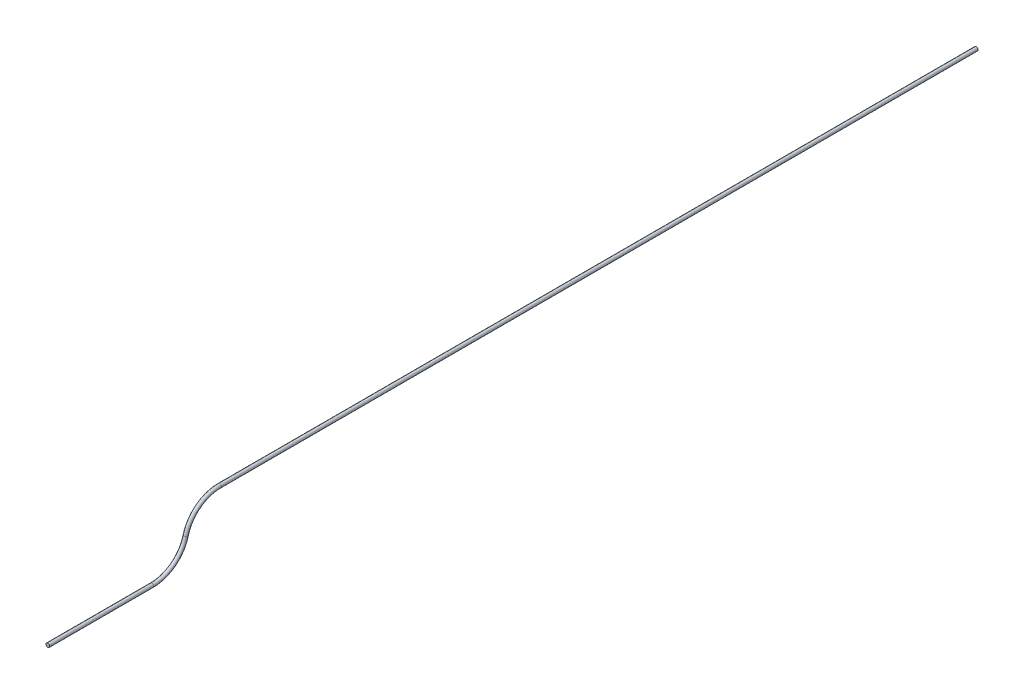
ISO-10303-21;
HEADER;
FILE_DESCRIPTION(('STEP AP214'),'2;1');
FILE_NAME('part.step','',(''),(''),'','','');
FILE_SCHEMA(('AUTOMOTIVE_DESIGN { 1 0 10303 214 1 1 1 1 }'));
ENDSEC;
DATA;
#1=APPLICATION_CONTEXT('core data for automotive mechanical design processes');
#2=APPLICATION_PROTOCOL_DEFINITION('international standard','automotive_design',2000,#1);
#3=PRODUCT_CONTEXT('',#1,'mechanical');
#4=PRODUCT('Part','Part','',(#3));
#5=PRODUCT_RELATED_PRODUCT_CATEGORY('part','',(#4));
#6=PRODUCT_DEFINITION_FORMATION('','',#4);
#7=PRODUCT_DEFINITION_CONTEXT('part definition',#1,'design');
#8=PRODUCT_DEFINITION('design','',#6,#7);
#9=PRODUCT_DEFINITION_SHAPE('','',#8);
#10=(LENGTH_UNIT() NAMED_UNIT(*) SI_UNIT(.MILLI.,.METRE.));
#11=(NAMED_UNIT(*) PLANE_ANGLE_UNIT() SI_UNIT($,.RADIAN.));
#12=(NAMED_UNIT(*) SI_UNIT($,.STERADIAN.) SOLID_ANGLE_UNIT());
#13=UNCERTAINTY_MEASURE_WITH_UNIT(LENGTH_MEASURE(1.E-05),#10,'distance_accuracy_value','');
#14=(GEOMETRIC_REPRESENTATION_CONTEXT(3) GLOBAL_UNCERTAINTY_ASSIGNED_CONTEXT((#13)) GLOBAL_UNIT_ASSIGNED_CONTEXT((#10,
#11,#12)) REPRESENTATION_CONTEXT('',''));
#15=CARTESIAN_POINT('',(0.,0.,0.));
#16=DIRECTION('',(0.,0.,1.));
#17=DIRECTION('',(1.,0.,0.));
#18=AXIS2_PLACEMENT_3D('',#15,#16,#17);
#19=CARTESIAN_POINT('',(0.,114.3,-374.560665490503));
#20=DIRECTION('',(0.,0.,-1.));
#21=DIRECTION('',(-1.,0.,0.));
#22=AXIS2_PLACEMENT_3D('',#19,#20,#21);
#23=CYLINDRICAL_SURFACE('',#22,4.03225);
#24=CARTESIAN_POINT('',(0.,114.3,-374.560665490503));
#25=DIRECTION('',(0.,0.,1.));
#26=DIRECTION('',(1.,0.,0.));
#27=AXIS2_PLACEMENT_3D('',#24,#25,#26);
#28=CIRCLE('',#27,4.03225);
#29=CARTESIAN_POINT('',(0.,118.33225,-374.560665490503));
#30=VERTEX_POINT('',#29);
#31=EDGE_CURVE('E47',#30,#30,#28,.T.);
#32=ORIENTED_EDGE('',*,*,#31,.F.);
#33=EDGE_LOOP('',(#32));
#34=FACE_BOUND('',#33,.T.);
#35=CARTESIAN_POINT('',(0.,114.3,-2025.5606654905));
#36=DIRECTION('',(0.,0.,1.));
#37=DIRECTION('',(1.,0.,0.));
#38=AXIS2_PLACEMENT_3D('',#35,#36,#37);
#39=CIRCLE('',#38,4.03225);
#40=CARTESIAN_POINT('',(4.03225,114.3,-2025.5606654905));
#41=VERTEX_POINT('',#40);
#42=EDGE_CURVE('E10',#41,#41,#39,.T.);
#43=ORIENTED_EDGE('',*,*,#42,.T.);
#44=EDGE_LOOP('',(#43));
#45=FACE_BOUND('',#44,.T.);
#46=ADVANCED_FACE('F41',(#34,#45),#23,.T.);
#47=CARTESIAN_POINT('',(0.,38.1,-374.560665490503));
#48=DIRECTION('',(-1.,0.,0.));
#49=DIRECTION('',(0.,0.,1.));
#50=AXIS2_PLACEMENT_3D('',#47,#48,#49);
#51=TOROIDAL_SURFACE('',#50,76.2,4.03225);
#52=CARTESIAN_POINT('',(0.,57.15,-300.780332745251));
#53=DIRECTION('',(0.,-0.968245836551854,0.25));
#54=DIRECTION('',(1.,0.,0.));
#55=AXIS2_PLACEMENT_3D('',#52,#53,#54);
#56=CIRCLE('',#55,4.03225);
#57=CARTESIAN_POINT('',(0.,58.1580625,-296.876123470815));
#58=VERTEX_POINT('',#57);
#59=EDGE_CURVE('E52',#58,#58,#56,.T.);
#60=CARTESIAN_POINT('',(0.,38.1,-374.560665490503));
#61=DIRECTION('',(-1.,0.,0.));
#62=DIRECTION('',(0.,0.,1.));
#63=AXIS2_PLACEMENT_3D('',#60,#61,#62);
#64=CIRCLE('',#63,80.23225);
#65=EDGE_CURVE('',#58,#30,#64,.T.);
#66=ORIENTED_EDGE('',*,*,#59,.F.);
#67=ORIENTED_EDGE('',*,*,#31,.T.);
#68=ORIENTED_EDGE('',*,*,#65,.T.);
#69=ORIENTED_EDGE('',*,*,#65,.F.);
#70=EDGE_LOOP('',(#66,#68,#67,#69));
#71=FACE_BOUND('',#70,.T.);
#72=ADVANCED_FACE('F74',(#71),#51,.T.);
#73=CARTESIAN_POINT('',(0.,76.2,-227.));
#74=DIRECTION('',(1.,0.,0.));
#75=DIRECTION('',(0.,0.,-1.));
#76=AXIS2_PLACEMENT_3D('',#73,#74,#75);
#77=TOROIDAL_SURFACE('',#76,76.2,4.03225);
#78=CARTESIAN_POINT('',(0.,0.,-227.));
#79=DIRECTION('',(0.,0.,1.));
#80=DIRECTION('',(1.,0.,0.));
#81=AXIS2_PLACEMENT_3D('',#78,#79,#80);
#82=CIRCLE('',#81,4.03225);
#83=CARTESIAN_POINT('',(4.03225,0.,-227.));
#84=VERTEX_POINT('',#83);
#85=EDGE_CURVE('E57',#84,#84,#82,.T.);
#86=ORIENTED_EDGE('',*,*,#85,.F.);
#87=EDGE_LOOP('',(#86));
#88=FACE_BOUND('',#87,.T.);
#89=ORIENTED_EDGE('',*,*,#59,.T.);
#90=EDGE_LOOP('',(#89));
#91=FACE_BOUND('',#90,.T.);
#92=ADVANCED_FACE('F71',(#88,#91),#77,.T.);
#93=CARTESIAN_POINT('',(0.,0.,-227.));
#94=DIRECTION('',(0.,0.,1.));
#95=DIRECTION('',(1.,0.,0.));
#96=AXIS2_PLACEMENT_3D('',#93,#94,#95);
#97=CYLINDRICAL_SURFACE('',#96,4.03225);
#98=ORIENTED_EDGE('',*,*,#85,.T.);
#99=EDGE_LOOP('',(#98));
#100=FACE_BOUND('',#99,.T.);
#101=CARTESIAN_POINT('',(0.,0.,0.));
#102=DIRECTION('',(0.,0.,1.));
#103=DIRECTION('',(1.,0.,0.));
#104=AXIS2_PLACEMENT_3D('',#101,#102,#103);
#105=CIRCLE('',#104,4.03225);
#106=CARTESIAN_POINT('',(4.03225,0.,0.));
#107=VERTEX_POINT('',#106);
#108=EDGE_CURVE('E60',#107,#107,#105,.T.);
#109=ORIENTED_EDGE('',*,*,#108,.F.);
#110=EDGE_LOOP('',(#109));
#111=FACE_BOUND('',#110,.T.);
#112=ADVANCED_FACE('F68',(#100,#111),#97,.T.);
#113=CARTESIAN_POINT('',(0.,114.3,-2025.5606654905));
#114=DIRECTION('',(0.,0.,1.));
#115=DIRECTION('',(1.,0.,0.));
#116=AXIS2_PLACEMENT_3D('',#113,#114,#115);
#117=PLANE('',#116);
#118=ORIENTED_EDGE('',*,*,#42,.F.);
#119=EDGE_LOOP('',(#118));
#120=FACE_BOUND('',#119,.T.);
#121=ADVANCED_FACE('F86',(#120),#117,.F.);
#122=CARTESIAN_POINT('',(0.,0.,0.));
#123=DIRECTION('',(0.,0.,1.));
#124=DIRECTION('',(1.,0.,0.));
#125=AXIS2_PLACEMENT_3D('',#122,#123,#124);
#126=PLANE('',#125);
#127=ORIENTED_EDGE('',*,*,#108,.T.);
#128=EDGE_LOOP('',(#127));
#129=FACE_BOUND('',#128,.T.);
#130=ADVANCED_FACE('F87',(#129),#126,.T.);
#131=CLOSED_SHELL('',(#46,#72,#92,#112,#121,#130));
#132=MANIFOLD_SOLID_BREP('B2',#131);
#133=ADVANCED_BREP_SHAPE_REPRESENTATION('',(#18,#132),#14);
#134=SHAPE_DEFINITION_REPRESENTATION(#9,#133);
ENDSEC;
END-ISO-10303-21;
